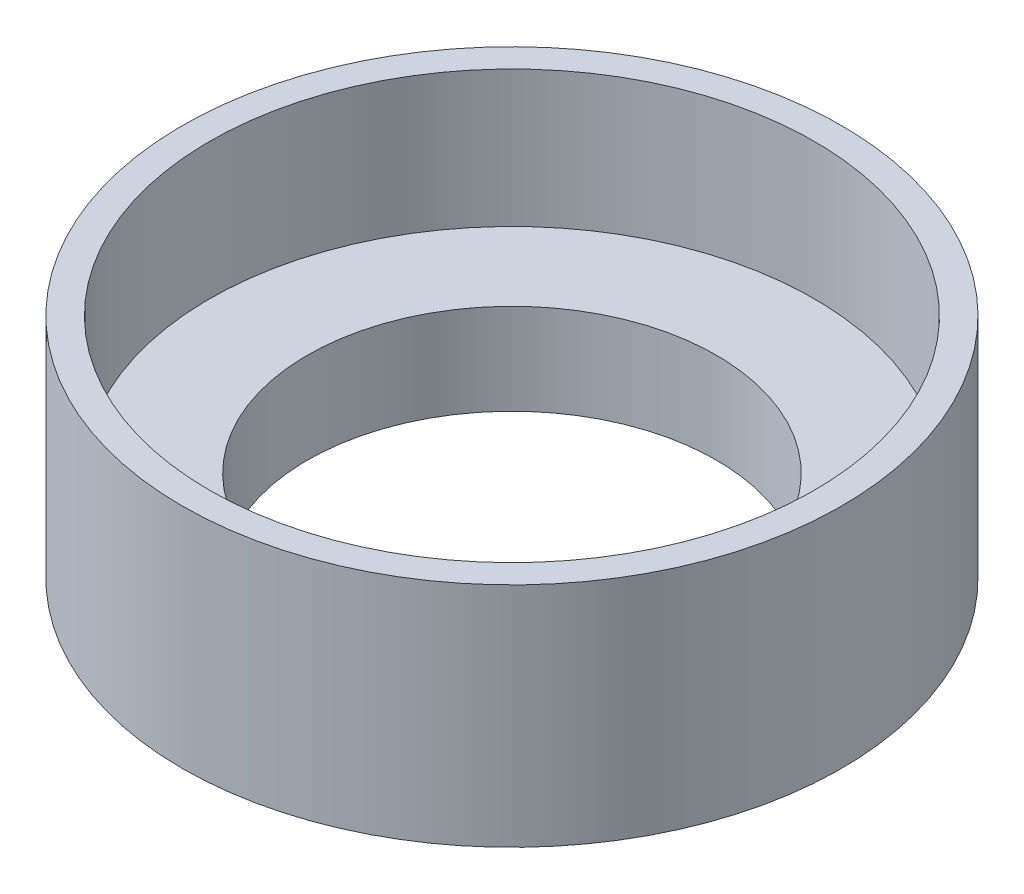
ISO-10303-21;
HEADER;
FILE_DESCRIPTION(('STEP AP214'),'2;1');
FILE_NAME('part.step','',(''),(''),'','','');
FILE_SCHEMA(('AUTOMOTIVE_DESIGN { 1 0 10303 214 1 1 1 1 }'));
ENDSEC;
DATA;
#1=APPLICATION_CONTEXT('core data for automotive mechanical design processes');
#2=APPLICATION_PROTOCOL_DEFINITION('international standard','automotive_design',2000,#1);
#3=PRODUCT_CONTEXT('',#1,'mechanical');
#4=PRODUCT('Part','Part','',(#3));
#5=PRODUCT_RELATED_PRODUCT_CATEGORY('part','',(#4));
#6=PRODUCT_DEFINITION_FORMATION('','',#4);
#7=PRODUCT_DEFINITION_CONTEXT('part definition',#1,'design');
#8=PRODUCT_DEFINITION('design','',#6,#7);
#9=PRODUCT_DEFINITION_SHAPE('','',#8);
#10=(LENGTH_UNIT() NAMED_UNIT(*) SI_UNIT(.MILLI.,.METRE.));
#11=(NAMED_UNIT(*) PLANE_ANGLE_UNIT() SI_UNIT($,.RADIAN.));
#12=(NAMED_UNIT(*) SI_UNIT($,.STERADIAN.) SOLID_ANGLE_UNIT());
#13=UNCERTAINTY_MEASURE_WITH_UNIT(LENGTH_MEASURE(1.E-05),#10,'distance_accuracy_value','');
#14=(GEOMETRIC_REPRESENTATION_CONTEXT(3) GLOBAL_UNCERTAINTY_ASSIGNED_CONTEXT((#13)) GLOBAL_UNIT_ASSIGNED_CONTEXT((#10,
#11,#12)) REPRESENTATION_CONTEXT('',''));
#15=CARTESIAN_POINT('',(0.,0.,0.));
#16=DIRECTION('',(0.,0.,1.));
#17=DIRECTION('',(1.,0.,0.));
#18=AXIS2_PLACEMENT_3D('',#15,#16,#17);
#19=CARTESIAN_POINT('',(0.,12.7,0.));
#20=DIRECTION('',(0.,-1.,0.));
#21=DIRECTION('',(0.,0.,-1.));
#22=AXIS2_PLACEMENT_3D('',#19,#20,#21);
#23=CYLINDRICAL_SURFACE('',#22,18.415);
#24=CARTESIAN_POINT('',(0.,12.7,0.));
#25=DIRECTION('',(0.,1.,0.));
#26=DIRECTION('',(0.,0.,1.));
#27=AXIS2_PLACEMENT_3D('',#24,#25,#26);
#28=CIRCLE('',#27,18.415);
#29=CARTESIAN_POINT('',(0.,12.7,18.415));
#30=VERTEX_POINT('',#29);
#31=EDGE_CURVE('E10',#30,#30,#28,.T.);
#32=ORIENTED_EDGE('',*,*,#31,.F.);
#33=EDGE_LOOP('',(#32));
#34=FACE_BOUND('',#33,.T.);
#35=CARTESIAN_POINT('',(0.,0.,0.));
#36=DIRECTION('',(0.,1.,0.));
#37=DIRECTION('',(0.,0.,1.));
#38=AXIS2_PLACEMENT_3D('',#35,#36,#37);
#39=CIRCLE('',#38,18.415);
#40=CARTESIAN_POINT('',(0.,0.,18.415));
#41=VERTEX_POINT('',#40);
#42=EDGE_CURVE('E40',#41,#41,#39,.T.);
#43=ORIENTED_EDGE('',*,*,#42,.T.);
#44=EDGE_LOOP('',(#43));
#45=FACE_BOUND('',#44,.T.);
#46=ADVANCED_FACE('F33',(#34,#45),#23,.T.);
#47=CARTESIAN_POINT('',(0.,12.7,0.));
#48=DIRECTION('',(0.,1.,0.));
#49=DIRECTION('',(0.,0.,1.));
#50=AXIS2_PLACEMENT_3D('',#47,#48,#49);
#51=PLANE('',#50);
#52=CARTESIAN_POINT('',(0.,12.7,0.));
#53=DIRECTION('',(0.,1.,0.));
#54=DIRECTION('',(0.,0.,1.));
#55=AXIS2_PLACEMENT_3D('',#52,#53,#54);
#56=CIRCLE('',#55,16.891);
#57=CARTESIAN_POINT('',(0.,12.7,16.891));
#58=VERTEX_POINT('',#57);
#59=EDGE_CURVE('E47',#58,#58,#56,.T.);
#60=ORIENTED_EDGE('',*,*,#59,.F.);
#61=EDGE_LOOP('',(#60));
#62=FACE_BOUND('',#61,.T.);
#63=ORIENTED_EDGE('',*,*,#31,.T.);
#64=EDGE_LOOP('',(#63));
#65=FACE_BOUND('',#64,.T.);
#66=ADVANCED_FACE('F72',(#62,#65),#51,.T.);
#67=CARTESIAN_POINT('',(0.,0.,0.));
#68=DIRECTION('',(0.,1.,0.));
#69=DIRECTION('',(0.,0.,1.));
#70=AXIS2_PLACEMENT_3D('',#67,#68,#69);
#71=PLANE('',#70);
#72=CARTESIAN_POINT('',(0.,0.,0.));
#73=DIRECTION('',(0.,1.,0.));
#74=DIRECTION('',(0.,0.,1.));
#75=AXIS2_PLACEMENT_3D('',#72,#73,#74);
#76=CIRCLE('',#75,11.43);
#77=CARTESIAN_POINT('',(0.,0.,11.43));
#78=VERTEX_POINT('',#77);
#79=EDGE_CURVE('E52',#78,#78,#76,.T.);
#80=ORIENTED_EDGE('',*,*,#79,.T.);
#81=EDGE_LOOP('',(#80));
#82=FACE_BOUND('',#81,.T.);
#83=ORIENTED_EDGE('',*,*,#42,.F.);
#84=EDGE_LOOP('',(#83));
#85=FACE_BOUND('',#84,.T.);
#86=ADVANCED_FACE('F77',(#82,#85),#71,.F.);
#87=CARTESIAN_POINT('',(0.,5.08,0.));
#88=DIRECTION('',(0.,1.,0.));
#89=DIRECTION('',(0.,0.,1.));
#90=AXIS2_PLACEMENT_3D('',#87,#88,#89);
#91=CYLINDRICAL_SURFACE('',#90,16.891);
#92=CARTESIAN_POINT('',(0.,5.08,0.));
#93=DIRECTION('',(0.,1.,0.));
#94=DIRECTION('',(0.,0.,1.));
#95=AXIS2_PLACEMENT_3D('',#92,#93,#94);
#96=CIRCLE('',#95,16.891);
#97=CARTESIAN_POINT('',(0.,5.08,16.891));
#98=VERTEX_POINT('',#97);
#99=EDGE_CURVE('E45',#98,#98,#96,.T.);
#100=ORIENTED_EDGE('',*,*,#99,.F.);
#101=EDGE_LOOP('',(#100));
#102=FACE_BOUND('',#101,.T.);
#103=ORIENTED_EDGE('',*,*,#59,.T.);
#104=EDGE_LOOP('',(#103));
#105=FACE_BOUND('',#104,.T.);
#106=ADVANCED_FACE('F69',(#102,#105),#91,.F.);
#107=CARTESIAN_POINT('',(0.,5.08,0.));
#108=DIRECTION('',(0.,1.,0.));
#109=DIRECTION('',(0.,0.,1.));
#110=AXIS2_PLACEMENT_3D('',#107,#108,#109);
#111=PLANE('',#110);
#112=CARTESIAN_POINT('',(0.,5.08,0.));
#113=DIRECTION('',(0.,1.,0.));
#114=DIRECTION('',(0.,0.,1.));
#115=AXIS2_PLACEMENT_3D('',#112,#113,#114);
#116=CIRCLE('',#115,11.43);
#117=CARTESIAN_POINT('',(0.,5.08,11.43));
#118=VERTEX_POINT('',#117);
#119=EDGE_CURVE('E36',#118,#118,#116,.F.);
#120=ORIENTED_EDGE('',*,*,#119,.T.);
#121=EDGE_LOOP('',(#120));
#122=FACE_BOUND('',#121,.T.);
#123=ORIENTED_EDGE('',*,*,#99,.T.);
#124=EDGE_LOOP('',(#123));
#125=FACE_BOUND('',#124,.T.);
#126=ADVANCED_FACE('F59',(#122,#125),#111,.T.);
#127=CARTESIAN_POINT('',(0.,12.7,0.));
#128=DIRECTION('',(0.,-1.,0.));
#129=DIRECTION('',(0.,0.,-1.));
#130=AXIS2_PLACEMENT_3D('',#127,#128,#129);
#131=CYLINDRICAL_SURFACE('',#130,11.43);
#132=ORIENTED_EDGE('',*,*,#119,.F.);
#133=EDGE_LOOP('',(#132));
#134=FACE_BOUND('',#133,.T.);
#135=ORIENTED_EDGE('',*,*,#79,.F.);
#136=EDGE_LOOP('',(#135));
#137=FACE_BOUND('',#136,.T.);
#138=ADVANCED_FACE('F62',(#134,#137),#131,.F.);
#139=CLOSED_SHELL('',(#46,#66,#86,#106,#126,#138));
#140=MANIFOLD_SOLID_BREP('B2',#139);
#141=ADVANCED_BREP_SHAPE_REPRESENTATION('',(#18,#140),#14);
#142=SHAPE_DEFINITION_REPRESENTATION(#9,#141);
ENDSEC;
END-ISO-10303-21;
